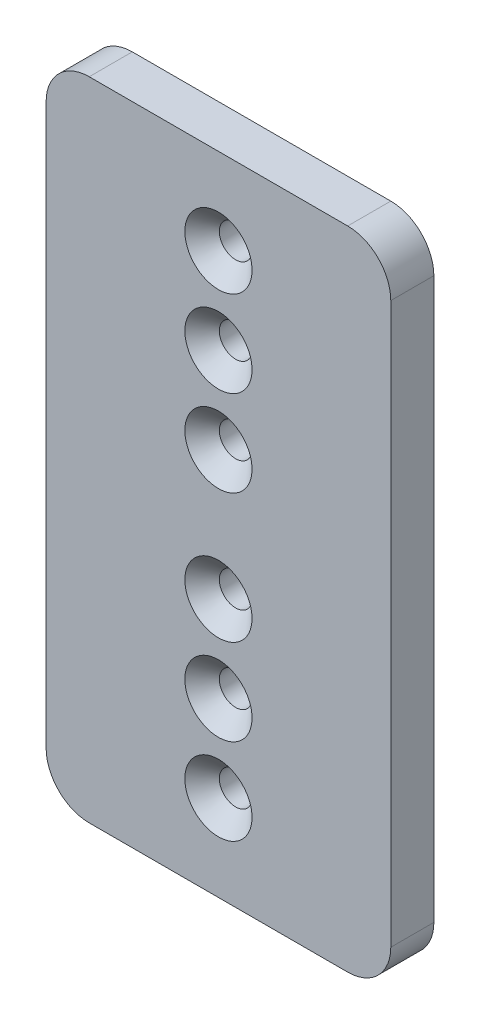
ISO-10303-21;
HEADER;
FILE_DESCRIPTION(('STEP AP214'),'2;1');
FILE_NAME('part.step','',(''),(''),'','','');
FILE_SCHEMA(('AUTOMOTIVE_DESIGN { 1 0 10303 214 1 1 1 1 }'));
ENDSEC;
DATA;
#1=APPLICATION_CONTEXT('core data for automotive mechanical design processes');
#2=APPLICATION_PROTOCOL_DEFINITION('international standard','automotive_design',2000,#1);
#3=PRODUCT_CONTEXT('',#1,'mechanical');
#4=PRODUCT('Part','Part','',(#3));
#5=PRODUCT_RELATED_PRODUCT_CATEGORY('part','',(#4));
#6=PRODUCT_DEFINITION_FORMATION('','',#4);
#7=PRODUCT_DEFINITION_CONTEXT('part definition',#1,'design');
#8=PRODUCT_DEFINITION('design','',#6,#7);
#9=PRODUCT_DEFINITION_SHAPE('','',#8);
#10=(LENGTH_UNIT() NAMED_UNIT(*) SI_UNIT(.MILLI.,.METRE.));
#11=(NAMED_UNIT(*) PLANE_ANGLE_UNIT() SI_UNIT($,.RADIAN.));
#12=(NAMED_UNIT(*) SI_UNIT($,.STERADIAN.) SOLID_ANGLE_UNIT());
#13=UNCERTAINTY_MEASURE_WITH_UNIT(LENGTH_MEASURE(1.E-05),#10,'distance_accuracy_value','');
#14=(GEOMETRIC_REPRESENTATION_CONTEXT(3) GLOBAL_UNCERTAINTY_ASSIGNED_CONTEXT((#13)) GLOBAL_UNIT_ASSIGNED_CONTEXT((#10,
#11,#12)) REPRESENTATION_CONTEXT('',''));
#15=CARTESIAN_POINT('',(0.,0.,0.));
#16=DIRECTION('',(0.,0.,1.));
#17=DIRECTION('',(1.,0.,0.));
#18=AXIS2_PLACEMENT_3D('',#15,#16,#17);
#19=CARTESIAN_POINT('',(0.,95.25,6.35));
#20=DIRECTION('',(0.,0.,-1.));
#21=DIRECTION('',(-1.,0.,0.));
#22=AXIS2_PLACEMENT_3D('',#19,#20,#21);
#23=PLANE('',#22);
#24=CARTESIAN_POINT('',(25.4,12.7,6.35));
#25=DIRECTION('',(0.,0.,-1.));
#26=DIRECTION('',(-1.,0.,0.));
#27=AXIS2_PLACEMENT_3D('',#24,#25,#26);
#28=CIRCLE('',#27,4.953);
#29=CARTESIAN_POINT('',(20.447,12.7,6.35));
#30=VERTEX_POINT('',#29);
#31=EDGE_CURVE('E183',#30,#30,#28,.T.);
#32=ORIENTED_EDGE('',*,*,#31,.T.);
#33=EDGE_LOOP('',(#32));
#34=FACE_BOUND('',#33,.T.);
#35=CARTESIAN_POINT('',(25.4,82.55,6.35));
#36=DIRECTION('',(0.,0.,-1.));
#37=DIRECTION('',(-1.,0.,0.));
#38=AXIS2_PLACEMENT_3D('',#35,#36,#37);
#39=CIRCLE('',#38,4.953);
#40=CARTESIAN_POINT('',(20.447,82.55,6.35));
#41=VERTEX_POINT('',#40);
#42=EDGE_CURVE('E180',#41,#41,#39,.T.);
#43=ORIENTED_EDGE('',*,*,#42,.T.);
#44=EDGE_LOOP('',(#43));
#45=FACE_BOUND('',#44,.T.);
#46=CARTESIAN_POINT('',(25.4,57.15,6.35));
#47=DIRECTION('',(0.,0.,-1.));
#48=DIRECTION('',(-1.,0.,0.));
#49=AXIS2_PLACEMENT_3D('',#46,#47,#48);
#50=CIRCLE('',#49,4.953);
#51=CARTESIAN_POINT('',(20.447,57.15,6.35));
#52=VERTEX_POINT('',#51);
#53=EDGE_CURVE('E177',#52,#52,#50,.T.);
#54=ORIENTED_EDGE('',*,*,#53,.T.);
#55=EDGE_LOOP('',(#54));
#56=FACE_BOUND('',#55,.T.);
#57=CARTESIAN_POINT('',(25.4,38.1,6.35));
#58=DIRECTION('',(0.,0.,-1.));
#59=DIRECTION('',(-1.,0.,0.));
#60=AXIS2_PLACEMENT_3D('',#57,#58,#59);
#61=CIRCLE('',#60,4.953);
#62=CARTESIAN_POINT('',(20.447,38.1,6.35));
#63=VERTEX_POINT('',#62);
#64=EDGE_CURVE('E174',#63,#63,#61,.T.);
#65=ORIENTED_EDGE('',*,*,#64,.T.);
#66=EDGE_LOOP('',(#65));
#67=FACE_BOUND('',#66,.T.);
#68=CARTESIAN_POINT('',(25.4,25.4,6.35));
#69=DIRECTION('',(0.,0.,-1.));
#70=DIRECTION('',(-1.,0.,0.));
#71=AXIS2_PLACEMENT_3D('',#68,#69,#70);
#72=CIRCLE('',#71,4.95300000000001);
#73=CARTESIAN_POINT('',(20.447,25.4,6.35));
#74=VERTEX_POINT('',#73);
#75=EDGE_CURVE('E171',#74,#74,#72,.T.);
#76=ORIENTED_EDGE('',*,*,#75,.T.);
#77=EDGE_LOOP('',(#76));
#78=FACE_BOUND('',#77,.T.);
#79=CARTESIAN_POINT('',(25.4,69.85,6.35));
#80=DIRECTION('',(0.,0.,-1.));
#81=DIRECTION('',(-1.,0.,0.));
#82=AXIS2_PLACEMENT_3D('',#79,#80,#81);
#83=CIRCLE('',#82,4.953);
#84=CARTESIAN_POINT('',(20.447,69.85,6.35));
#85=VERTEX_POINT('',#84);
#86=EDGE_CURVE('E168',#85,#85,#83,.T.);
#87=ORIENTED_EDGE('',*,*,#86,.T.);
#88=EDGE_LOOP('',(#87));
#89=FACE_BOUND('',#88,.T.);
#90=DIRECTION('',(0.,-1.,0.));
#91=VECTOR('',#90,1.);
#92=CARTESIAN_POINT('',(0.,0.,6.35));
#93=LINE('',#92,#91);
#94=CARTESIAN_POINT('',(0.,88.9,6.35));
#95=VERTEX_POINT('',#94);
#96=CARTESIAN_POINT('',(0.,6.35,6.35));
#97=VERTEX_POINT('',#96);
#98=EDGE_CURVE('E139',#95,#97,#93,.T.);
#99=ORIENTED_EDGE('',*,*,#98,.T.);
#100=CARTESIAN_POINT('',(6.35,6.35,6.35));
#101=DIRECTION('',(0.,0.,-1.));
#102=DIRECTION('',(-1.,0.,0.));
#103=AXIS2_PLACEMENT_3D('',#100,#101,#102);
#104=CIRCLE('',#103,6.35);
#105=CARTESIAN_POINT('',(6.35,0.,6.35));
#106=VERTEX_POINT('',#105);
#107=EDGE_CURVE('E154',#97,#106,#104,.F.);
#108=ORIENTED_EDGE('',*,*,#107,.T.);
#109=DIRECTION('',(1.,0.,0.));
#110=VECTOR('',#109,1.);
#111=CARTESIAN_POINT('',(0.,0.,6.35));
#112=LINE('',#111,#110);
#113=CARTESIAN_POINT('',(44.45,0.,6.35));
#114=VERTEX_POINT('',#113);
#115=EDGE_CURVE('E121',#106,#114,#112,.T.);
#116=ORIENTED_EDGE('',*,*,#115,.T.);
#117=CARTESIAN_POINT('',(44.45,6.35,6.35));
#118=DIRECTION('',(0.,0.,-1.));
#119=DIRECTION('',(-1.,0.,0.));
#120=AXIS2_PLACEMENT_3D('',#117,#118,#119);
#121=CIRCLE('',#120,6.35);
#122=CARTESIAN_POINT('',(50.8,6.35000000000001,6.35));
#123=VERTEX_POINT('',#122);
#124=EDGE_CURVE('E152',#114,#123,#121,.F.);
#125=ORIENTED_EDGE('',*,*,#124,.T.);
#126=DIRECTION('',(0.,1.,0.));
#127=VECTOR('',#126,1.);
#128=CARTESIAN_POINT('',(50.8,0.,6.35));
#129=LINE('',#128,#127);
#130=CARTESIAN_POINT('',(50.8,88.9,6.35));
#131=VERTEX_POINT('',#130);
#132=EDGE_CURVE('E294',#123,#131,#129,.T.);
#133=ORIENTED_EDGE('',*,*,#132,.T.);
#134=CARTESIAN_POINT('',(44.45,88.9,6.35));
#135=DIRECTION('',(0.,0.,-1.));
#136=DIRECTION('',(-1.,0.,0.));
#137=AXIS2_PLACEMENT_3D('',#134,#135,#136);
#138=CIRCLE('',#137,6.35);
#139=CARTESIAN_POINT('',(44.45,95.25,6.35));
#140=VERTEX_POINT('',#139);
#141=EDGE_CURVE('E56',#131,#140,#138,.F.);
#142=ORIENTED_EDGE('',*,*,#141,.T.);
#143=DIRECTION('',(-1.,0.,0.));
#144=VECTOR('',#143,1.);
#145=CARTESIAN_POINT('',(0.,95.25,6.35));
#146=LINE('',#145,#144);
#147=CARTESIAN_POINT('',(6.35,95.25,6.35));
#148=VERTEX_POINT('',#147);
#149=EDGE_CURVE('E140',#140,#148,#146,.T.);
#150=ORIENTED_EDGE('',*,*,#149,.T.);
#151=CARTESIAN_POINT('',(6.35,88.9,6.35));
#152=DIRECTION('',(0.,0.,-1.));
#153=DIRECTION('',(-1.,0.,0.));
#154=AXIS2_PLACEMENT_3D('',#151,#152,#153);
#155=CIRCLE('',#154,6.35);
#156=EDGE_CURVE('E149',#148,#95,#155,.F.);
#157=ORIENTED_EDGE('',*,*,#156,.T.);
#158=EDGE_LOOP('',(#99,#108,#116,#125,#133,#142,#150,#157));
#159=FACE_BOUND('',#158,.T.);
#160=ADVANCED_FACE('F34',(#34,#45,#56,#67,#78,#89,#159),#23,.F.);
#161=CARTESIAN_POINT('',(0.,95.25,0.));
#162=DIRECTION('',(0.,0.,-1.));
#163=DIRECTION('',(-1.,0.,0.));
#164=AXIS2_PLACEMENT_3D('',#161,#162,#163);
#165=PLANE('',#164);
#166=CARTESIAN_POINT('',(25.4,38.1,0.));
#167=DIRECTION('',(0.,0.,1.));
#168=DIRECTION('',(1.,0.,0.));
#169=AXIS2_PLACEMENT_3D('',#166,#167,#168);
#170=CIRCLE('',#169,2.413);
#171=CARTESIAN_POINT('',(27.813,38.1,0.));
#172=VERTEX_POINT('',#171);
#173=EDGE_CURVE('E285',#172,#172,#170,.T.);
#174=ORIENTED_EDGE('',*,*,#173,.T.);
#175=EDGE_LOOP('',(#174));
#176=FACE_BOUND('',#175,.T.);
#177=CARTESIAN_POINT('',(25.4,57.15,0.));
#178=DIRECTION('',(0.,0.,1.));
#179=DIRECTION('',(1.,0.,0.));
#180=AXIS2_PLACEMENT_3D('',#177,#178,#179);
#181=CIRCLE('',#180,2.413);
#182=CARTESIAN_POINT('',(27.813,57.15,0.));
#183=VERTEX_POINT('',#182);
#184=EDGE_CURVE('E277',#183,#183,#181,.T.);
#185=ORIENTED_EDGE('',*,*,#184,.T.);
#186=EDGE_LOOP('',(#185));
#187=FACE_BOUND('',#186,.T.);
#188=CARTESIAN_POINT('',(25.4,69.85,0.));
#189=DIRECTION('',(0.,0.,1.));
#190=DIRECTION('',(1.,0.,0.));
#191=AXIS2_PLACEMENT_3D('',#188,#189,#190);
#192=CIRCLE('',#191,2.413);
#193=CARTESIAN_POINT('',(27.813,69.85,0.));
#194=VERTEX_POINT('',#193);
#195=EDGE_CURVE('E134',#194,#194,#192,.T.);
#196=ORIENTED_EDGE('',*,*,#195,.T.);
#197=EDGE_LOOP('',(#196));
#198=FACE_BOUND('',#197,.T.);
#199=DIRECTION('',(1.,0.,0.));
#200=VECTOR('',#199,1.);
#201=CARTESIAN_POINT('',(0.,0.,0.));
#202=LINE('',#201,#200);
#203=CARTESIAN_POINT('',(6.35,0.,0.));
#204=VERTEX_POINT('',#203);
#205=CARTESIAN_POINT('',(44.45,0.,0.));
#206=VERTEX_POINT('',#205);
#207=EDGE_CURVE('E118',#204,#206,#202,.T.);
#208=ORIENTED_EDGE('',*,*,#207,.F.);
#209=CARTESIAN_POINT('',(6.35,6.35,0.));
#210=DIRECTION('',(0.,0.,-1.));
#211=DIRECTION('',(-1.,0.,0.));
#212=AXIS2_PLACEMENT_3D('',#209,#210,#211);
#213=CIRCLE('',#212,6.35);
#214=CARTESIAN_POINT('',(0.,6.35,0.));
#215=VERTEX_POINT('',#214);
#216=EDGE_CURVE('E101',#204,#215,#213,.T.);
#217=ORIENTED_EDGE('',*,*,#216,.T.);
#218=DIRECTION('',(0.,-1.,0.));
#219=VECTOR('',#218,1.);
#220=CARTESIAN_POINT('',(0.,0.,0.));
#221=LINE('',#220,#219);
#222=CARTESIAN_POINT('',(0.,88.9,0.));
#223=VERTEX_POINT('',#222);
#224=EDGE_CURVE('E129',#223,#215,#221,.T.);
#225=ORIENTED_EDGE('',*,*,#224,.F.);
#226=CARTESIAN_POINT('',(6.35,88.9,0.));
#227=DIRECTION('',(0.,0.,-1.));
#228=DIRECTION('',(-1.,0.,0.));
#229=AXIS2_PLACEMENT_3D('',#226,#227,#228);
#230=CIRCLE('',#229,6.35);
#231=CARTESIAN_POINT('',(6.35,95.25,0.));
#232=VERTEX_POINT('',#231);
#233=EDGE_CURVE('E122',#223,#232,#230,.T.);
#234=ORIENTED_EDGE('',*,*,#233,.T.);
#235=DIRECTION('',(-1.,0.,0.));
#236=VECTOR('',#235,1.);
#237=CARTESIAN_POINT('',(0.,95.25,0.));
#238=LINE('',#237,#236);
#239=CARTESIAN_POINT('',(44.45,95.25,0.));
#240=VERTEX_POINT('',#239);
#241=EDGE_CURVE('E132',#240,#232,#238,.T.);
#242=ORIENTED_EDGE('',*,*,#241,.F.);
#243=CARTESIAN_POINT('',(44.45,88.9,0.));
#244=DIRECTION('',(0.,0.,-1.));
#245=DIRECTION('',(-1.,0.,0.));
#246=AXIS2_PLACEMENT_3D('',#243,#244,#245);
#247=CIRCLE('',#246,6.35);
#248=CARTESIAN_POINT('',(50.8,88.9,0.));
#249=VERTEX_POINT('',#248);
#250=EDGE_CURVE('E143',#240,#249,#247,.T.);
#251=ORIENTED_EDGE('',*,*,#250,.T.);
#252=DIRECTION('',(0.,1.,0.));
#253=VECTOR('',#252,1.);
#254=CARTESIAN_POINT('',(50.8,0.,0.));
#255=LINE('',#254,#253);
#256=CARTESIAN_POINT('',(50.8,6.35000000000001,0.));
#257=VERTEX_POINT('',#256);
#258=EDGE_CURVE('E128',#257,#249,#255,.T.);
#259=ORIENTED_EDGE('',*,*,#258,.F.);
#260=CARTESIAN_POINT('',(44.45,6.35,0.));
#261=DIRECTION('',(0.,0.,-1.));
#262=DIRECTION('',(-1.,0.,0.));
#263=AXIS2_PLACEMENT_3D('',#260,#261,#262);
#264=CIRCLE('',#263,6.35);
#265=EDGE_CURVE('E112',#257,#206,#264,.T.);
#266=ORIENTED_EDGE('',*,*,#265,.T.);
#267=EDGE_LOOP('',(#208,#217,#225,#234,#242,#251,#259,#266));
#268=FACE_BOUND('',#267,.T.);
#269=CARTESIAN_POINT('',(25.4,25.4,0.));
#270=DIRECTION('',(0.,0.,1.));
#271=DIRECTION('',(1.,0.,0.));
#272=AXIS2_PLACEMENT_3D('',#269,#270,#271);
#273=CIRCLE('',#272,2.413);
#274=CARTESIAN_POINT('',(27.813,25.4,0.));
#275=VERTEX_POINT('',#274);
#276=EDGE_CURVE('E279',#275,#275,#273,.T.);
#277=ORIENTED_EDGE('',*,*,#276,.T.);
#278=EDGE_LOOP('',(#277));
#279=FACE_BOUND('',#278,.T.);
#280=CARTESIAN_POINT('',(25.4,12.7,0.));
#281=DIRECTION('',(0.,0.,1.));
#282=DIRECTION('',(1.,0.,0.));
#283=AXIS2_PLACEMENT_3D('',#280,#281,#282);
#284=CIRCLE('',#283,2.413);
#285=CARTESIAN_POINT('',(27.813,12.7,0.));
#286=VERTEX_POINT('',#285);
#287=EDGE_CURVE('E280',#286,#286,#284,.T.);
#288=ORIENTED_EDGE('',*,*,#287,.T.);
#289=EDGE_LOOP('',(#288));
#290=FACE_BOUND('',#289,.T.);
#291=CARTESIAN_POINT('',(25.4,82.55,0.));
#292=DIRECTION('',(0.,0.,1.));
#293=DIRECTION('',(1.,0.,0.));
#294=AXIS2_PLACEMENT_3D('',#291,#292,#293);
#295=CIRCLE('',#294,2.413);
#296=CARTESIAN_POINT('',(27.813,82.55,0.));
#297=VERTEX_POINT('',#296);
#298=EDGE_CURVE('E332',#297,#297,#295,.T.);
#299=ORIENTED_EDGE('',*,*,#298,.T.);
#300=EDGE_LOOP('',(#299));
#301=FACE_BOUND('',#300,.T.);
#302=ADVANCED_FACE('F125',(#176,#187,#198,#268,#279,#290,#301),#165,.T.);
#303=CARTESIAN_POINT('',(0.,0.,6.35));
#304=DIRECTION('',(1.,0.,0.));
#305=DIRECTION('',(0.,0.,-1.));
#306=AXIS2_PLACEMENT_3D('',#303,#304,#305);
#307=PLANE('',#306);
#308=ORIENTED_EDGE('',*,*,#224,.T.);
#309=DIRECTION('',(0.,0.,-1.));
#310=VECTOR('',#309,1.);
#311=CARTESIAN_POINT('',(0.,6.35,6.35));
#312=LINE('',#311,#310);
#313=EDGE_CURVE('E106',#215,#97,#312,.F.);
#314=ORIENTED_EDGE('',*,*,#313,.T.);
#315=ORIENTED_EDGE('',*,*,#98,.F.);
#316=DIRECTION('',(0.,0.,-1.));
#317=VECTOR('',#316,1.);
#318=CARTESIAN_POINT('',(0.,88.9,6.35));
#319=LINE('',#318,#317);
#320=EDGE_CURVE('E111',#95,#223,#319,.T.);
#321=ORIENTED_EDGE('',*,*,#320,.T.);
#322=EDGE_LOOP('',(#308,#314,#315,#321));
#323=FACE_BOUND('',#322,.T.);
#324=ADVANCED_FACE('F219',(#323),#307,.F.);
#325=CARTESIAN_POINT('',(0.,0.,6.35));
#326=DIRECTION('',(0.,1.,0.));
#327=DIRECTION('',(-1.,0.,0.));
#328=AXIS2_PLACEMENT_3D('',#325,#326,#327);
#329=PLANE('',#328);
#330=ORIENTED_EDGE('',*,*,#115,.F.);
#331=DIRECTION('',(0.,0.,-1.));
#332=VECTOR('',#331,1.);
#333=CARTESIAN_POINT('',(6.35,0.,6.35));
#334=LINE('',#333,#332);
#335=EDGE_CURVE('E105',#106,#204,#334,.T.);
#336=ORIENTED_EDGE('',*,*,#335,.T.);
#337=ORIENTED_EDGE('',*,*,#207,.T.);
#338=DIRECTION('',(0.,0.,-1.));
#339=VECTOR('',#338,1.);
#340=CARTESIAN_POINT('',(44.45,0.,6.35));
#341=LINE('',#340,#339);
#342=EDGE_CURVE('E123',#206,#114,#341,.F.);
#343=ORIENTED_EDGE('',*,*,#342,.T.);
#344=EDGE_LOOP('',(#330,#336,#337,#343));
#345=FACE_BOUND('',#344,.T.);
#346=ADVANCED_FACE('F117',(#345),#329,.F.);
#347=CARTESIAN_POINT('',(50.8,0.,6.35));
#348=DIRECTION('',(-1.,0.,0.));
#349=DIRECTION('',(0.,-1.,0.));
#350=AXIS2_PLACEMENT_3D('',#347,#348,#349);
#351=PLANE('',#350);
#352=ORIENTED_EDGE('',*,*,#132,.F.);
#353=DIRECTION('',(0.,0.,-1.));
#354=VECTOR('',#353,1.);
#355=CARTESIAN_POINT('',(50.8,6.35000000000001,6.35));
#356=LINE('',#355,#354);
#357=EDGE_CURVE('E158',#123,#257,#356,.T.);
#358=ORIENTED_EDGE('',*,*,#357,.T.);
#359=ORIENTED_EDGE('',*,*,#258,.T.);
#360=DIRECTION('',(0.,0.,-1.));
#361=VECTOR('',#360,1.);
#362=CARTESIAN_POINT('',(50.8,88.9,6.35));
#363=LINE('',#362,#361);
#364=EDGE_CURVE('E156',#249,#131,#363,.F.);
#365=ORIENTED_EDGE('',*,*,#364,.T.);
#366=EDGE_LOOP('',(#352,#358,#359,#365));
#367=FACE_BOUND('',#366,.T.);
#368=ADVANCED_FACE('F230',(#367),#351,.F.);
#369=CARTESIAN_POINT('',(0.,95.25,6.35));
#370=DIRECTION('',(0.,-1.,0.));
#371=DIRECTION('',(0.,0.,-1.));
#372=AXIS2_PLACEMENT_3D('',#369,#370,#371);
#373=PLANE('',#372);
#374=ORIENTED_EDGE('',*,*,#149,.F.);
#375=DIRECTION('',(0.,0.,-1.));
#376=VECTOR('',#375,1.);
#377=CARTESIAN_POINT('',(44.45,95.25,6.35));
#378=LINE('',#377,#376);
#379=EDGE_CURVE('E162',#140,#240,#378,.T.);
#380=ORIENTED_EDGE('',*,*,#379,.T.);
#381=ORIENTED_EDGE('',*,*,#241,.T.);
#382=DIRECTION('',(0.,0.,-1.));
#383=VECTOR('',#382,1.);
#384=CARTESIAN_POINT('',(6.35,95.25,6.35));
#385=LINE('',#384,#383);
#386=EDGE_CURVE('E49',#232,#148,#385,.F.);
#387=ORIENTED_EDGE('',*,*,#386,.T.);
#388=EDGE_LOOP('',(#374,#380,#381,#387));
#389=FACE_BOUND('',#388,.T.);
#390=ADVANCED_FACE('F227',(#389),#373,.F.);
#391=CARTESIAN_POINT('',(25.4,69.85,6.35));
#392=DIRECTION('',(0.,0.,-1.));
#393=DIRECTION('',(-1.,0.,0.));
#394=AXIS2_PLACEMENT_3D('',#391,#392,#393);
#395=CYLINDRICAL_SURFACE('',#394,2.413);
#396=CARTESIAN_POINT('',(25.4,69.85,3.81000000000002));
#397=DIRECTION('',(0.,0.,-1.));
#398=DIRECTION('',(-1.,0.,0.));
#399=AXIS2_PLACEMENT_3D('',#396,#397,#398);
#400=CIRCLE('',#399,2.413);
#401=CARTESIAN_POINT('',(22.987,69.85,3.81000000000002));
#402=VERTEX_POINT('',#401);
#403=EDGE_CURVE('E11',#402,#402,#400,.F.);
#404=ORIENTED_EDGE('',*,*,#403,.T.);
#405=EDGE_LOOP('',(#404));
#406=FACE_BOUND('',#405,.T.);
#407=ORIENTED_EDGE('',*,*,#195,.F.);
#408=EDGE_LOOP('',(#407));
#409=FACE_BOUND('',#408,.T.);
#410=ADVANCED_FACE('F224',(#406,#409),#395,.F.);
#411=CARTESIAN_POINT('',(25.4,25.4,6.35));
#412=DIRECTION('',(0.,0.,-1.));
#413=DIRECTION('',(-1.,0.,0.));
#414=AXIS2_PLACEMENT_3D('',#411,#412,#413);
#415=CYLINDRICAL_SURFACE('',#414,2.413);
#416=CARTESIAN_POINT('',(25.4,25.4,3.80999999999999));
#417=DIRECTION('',(0.,0.,-1.));
#418=DIRECTION('',(-1.,0.,0.));
#419=AXIS2_PLACEMENT_3D('',#416,#417,#418);
#420=CIRCLE('',#419,2.413);
#421=CARTESIAN_POINT('',(22.987,25.4,3.80999999999999));
#422=VERTEX_POINT('',#421);
#423=EDGE_CURVE('E42',#422,#422,#420,.F.);
#424=ORIENTED_EDGE('',*,*,#423,.T.);
#425=EDGE_LOOP('',(#424));
#426=FACE_BOUND('',#425,.T.);
#427=ORIENTED_EDGE('',*,*,#276,.F.);
#428=EDGE_LOOP('',(#427));
#429=FACE_BOUND('',#428,.T.);
#430=ADVANCED_FACE('F197',(#426,#429),#415,.F.);
#431=CARTESIAN_POINT('',(25.4,57.15,6.35));
#432=DIRECTION('',(0.,0.,-1.));
#433=DIRECTION('',(-1.,0.,0.));
#434=AXIS2_PLACEMENT_3D('',#431,#432,#433);
#435=CYLINDRICAL_SURFACE('',#434,2.413);
#436=CARTESIAN_POINT('',(25.4,57.15,3.81000000000002));
#437=DIRECTION('',(0.,0.,-1.));
#438=DIRECTION('',(-1.,0.,0.));
#439=AXIS2_PLACEMENT_3D('',#436,#437,#438);
#440=CIRCLE('',#439,2.413);
#441=CARTESIAN_POINT('',(22.987,57.15,3.81000000000002));
#442=VERTEX_POINT('',#441);
#443=EDGE_CURVE('E189',#442,#442,#440,.F.);
#444=ORIENTED_EDGE('',*,*,#443,.T.);
#445=EDGE_LOOP('',(#444));
#446=FACE_BOUND('',#445,.T.);
#447=ORIENTED_EDGE('',*,*,#184,.F.);
#448=EDGE_LOOP('',(#447));
#449=FACE_BOUND('',#448,.T.);
#450=ADVANCED_FACE('F270',(#446,#449),#435,.F.);
#451=CARTESIAN_POINT('',(25.4,12.7,6.35));
#452=DIRECTION('',(0.,0.,-1.));
#453=DIRECTION('',(-1.,0.,0.));
#454=AXIS2_PLACEMENT_3D('',#451,#452,#453);
#455=CYLINDRICAL_SURFACE('',#454,2.413);
#456=CARTESIAN_POINT('',(25.4,12.7,3.81000000000002));
#457=DIRECTION('',(0.,0.,-1.));
#458=DIRECTION('',(-1.,0.,0.));
#459=AXIS2_PLACEMENT_3D('',#456,#457,#458);
#460=CIRCLE('',#459,2.413);
#461=CARTESIAN_POINT('',(22.987,12.7,3.81000000000002));
#462=VERTEX_POINT('',#461);
#463=EDGE_CURVE('E165',#462,#462,#460,.F.);
#464=ORIENTED_EDGE('',*,*,#463,.T.);
#465=EDGE_LOOP('',(#464));
#466=FACE_BOUND('',#465,.T.);
#467=ORIENTED_EDGE('',*,*,#287,.F.);
#468=EDGE_LOOP('',(#467));
#469=FACE_BOUND('',#468,.T.);
#470=ADVANCED_FACE('F273',(#466,#469),#455,.F.);
#471=CARTESIAN_POINT('',(25.4,38.1,6.35));
#472=DIRECTION('',(0.,0.,-1.));
#473=DIRECTION('',(-1.,0.,0.));
#474=AXIS2_PLACEMENT_3D('',#471,#472,#473);
#475=CYLINDRICAL_SURFACE('',#474,2.413);
#476=CARTESIAN_POINT('',(25.4,38.1,3.81000000000002));
#477=DIRECTION('',(0.,0.,-1.));
#478=DIRECTION('',(-1.,0.,0.));
#479=AXIS2_PLACEMENT_3D('',#476,#477,#478);
#480=CIRCLE('',#479,2.413);
#481=CARTESIAN_POINT('',(22.987,38.1,3.81000000000002));
#482=VERTEX_POINT('',#481);
#483=EDGE_CURVE('E192',#482,#482,#480,.F.);
#484=ORIENTED_EDGE('',*,*,#483,.T.);
#485=EDGE_LOOP('',(#484));
#486=FACE_BOUND('',#485,.T.);
#487=ORIENTED_EDGE('',*,*,#173,.F.);
#488=EDGE_LOOP('',(#487));
#489=FACE_BOUND('',#488,.T.);
#490=ADVANCED_FACE('F319',(#486,#489),#475,.F.);
#491=CARTESIAN_POINT('',(25.4,82.55,6.35));
#492=DIRECTION('',(0.,0.,-1.));
#493=DIRECTION('',(-1.,0.,0.));
#494=AXIS2_PLACEMENT_3D('',#491,#492,#493);
#495=CYLINDRICAL_SURFACE('',#494,2.413);
#496=CARTESIAN_POINT('',(25.4,82.55,3.81000000000002));
#497=DIRECTION('',(0.,0.,-1.));
#498=DIRECTION('',(-1.,0.,0.));
#499=AXIS2_PLACEMENT_3D('',#496,#497,#498);
#500=CIRCLE('',#499,2.413);
#501=CARTESIAN_POINT('',(22.987,82.55,3.81000000000002));
#502=VERTEX_POINT('',#501);
#503=EDGE_CURVE('E186',#502,#502,#500,.F.);
#504=ORIENTED_EDGE('',*,*,#503,.T.);
#505=EDGE_LOOP('',(#504));
#506=FACE_BOUND('',#505,.T.);
#507=ORIENTED_EDGE('',*,*,#298,.F.);
#508=EDGE_LOOP('',(#507));
#509=FACE_BOUND('',#508,.T.);
#510=ADVANCED_FACE('F242',(#506,#509),#495,.F.);
#511=CARTESIAN_POINT('',(6.35,6.35,6.35));
#512=DIRECTION('',(0.,0.,-1.));
#513=DIRECTION('',(-1.,0.,0.));
#514=AXIS2_PLACEMENT_3D('',#511,#512,#513);
#515=CYLINDRICAL_SURFACE('',#514,6.35);
#516=ORIENTED_EDGE('',*,*,#107,.F.);
#517=ORIENTED_EDGE('',*,*,#313,.F.);
#518=ORIENTED_EDGE('',*,*,#216,.F.);
#519=ORIENTED_EDGE('',*,*,#335,.F.);
#520=EDGE_LOOP('',(#516,#517,#518,#519));
#521=FACE_BOUND('',#520,.T.);
#522=ADVANCED_FACE('F104',(#521),#515,.T.);
#523=CARTESIAN_POINT('',(44.45,6.35,6.35));
#524=DIRECTION('',(0.,0.,-1.));
#525=DIRECTION('',(-1.,0.,0.));
#526=AXIS2_PLACEMENT_3D('',#523,#524,#525);
#527=CYLINDRICAL_SURFACE('',#526,6.35);
#528=ORIENTED_EDGE('',*,*,#124,.F.);
#529=ORIENTED_EDGE('',*,*,#342,.F.);
#530=ORIENTED_EDGE('',*,*,#265,.F.);
#531=ORIENTED_EDGE('',*,*,#357,.F.);
#532=EDGE_LOOP('',(#528,#529,#530,#531));
#533=FACE_BOUND('',#532,.T.);
#534=ADVANCED_FACE('F241',(#533),#527,.T.);
#535=CARTESIAN_POINT('',(44.45,88.9,6.35));
#536=DIRECTION('',(0.,0.,-1.));
#537=DIRECTION('',(-1.,0.,0.));
#538=AXIS2_PLACEMENT_3D('',#535,#536,#537);
#539=CYLINDRICAL_SURFACE('',#538,6.35);
#540=ORIENTED_EDGE('',*,*,#141,.F.);
#541=ORIENTED_EDGE('',*,*,#364,.F.);
#542=ORIENTED_EDGE('',*,*,#250,.F.);
#543=ORIENTED_EDGE('',*,*,#379,.F.);
#544=EDGE_LOOP('',(#540,#541,#542,#543));
#545=FACE_BOUND('',#544,.T.);
#546=ADVANCED_FACE('F245',(#545),#539,.T.);
#547=CARTESIAN_POINT('',(6.35,88.9,6.35));
#548=DIRECTION('',(0.,0.,-1.));
#549=DIRECTION('',(-1.,0.,0.));
#550=AXIS2_PLACEMENT_3D('',#547,#548,#549);
#551=CYLINDRICAL_SURFACE('',#550,6.35);
#552=ORIENTED_EDGE('',*,*,#156,.F.);
#553=ORIENTED_EDGE('',*,*,#386,.F.);
#554=ORIENTED_EDGE('',*,*,#233,.F.);
#555=ORIENTED_EDGE('',*,*,#320,.F.);
#556=EDGE_LOOP('',(#552,#553,#554,#555));
#557=FACE_BOUND('',#556,.T.);
#558=ADVANCED_FACE('F249',(#557),#551,.T.);
#559=CARTESIAN_POINT('',(25.4,12.7,3.81000000000002));
#560=DIRECTION('',(0.,0.,1.));
#561=DIRECTION('',(1.,0.,0.));
#562=AXIS2_PLACEMENT_3D('',#559,#560,#561);
#563=CONICAL_SURFACE('',#562,2.413,0.785398163397452);
#564=ORIENTED_EDGE('',*,*,#31,.F.);
#565=EDGE_LOOP('',(#564));
#566=FACE_BOUND('',#565,.T.);
#567=ORIENTED_EDGE('',*,*,#463,.F.);
#568=EDGE_LOOP('',(#567));
#569=FACE_BOUND('',#568,.T.);
#570=ADVANCED_FACE('F253',(#566,#569),#563,.F.);
#571=CARTESIAN_POINT('',(25.4,82.55,3.81000000000002));
#572=DIRECTION('',(0.,0.,1.));
#573=DIRECTION('',(1.,0.,0.));
#574=AXIS2_PLACEMENT_3D('',#571,#572,#573);
#575=CONICAL_SURFACE('',#574,2.413,0.785398163397452);
#576=ORIENTED_EDGE('',*,*,#42,.F.);
#577=EDGE_LOOP('',(#576));
#578=FACE_BOUND('',#577,.T.);
#579=ORIENTED_EDGE('',*,*,#503,.F.);
#580=EDGE_LOOP('',(#579));
#581=FACE_BOUND('',#580,.T.);
#582=ADVANCED_FACE('F257',(#578,#581),#575,.F.);
#583=CARTESIAN_POINT('',(25.4,57.15,3.81000000000002));
#584=DIRECTION('',(0.,0.,1.));
#585=DIRECTION('',(1.,0.,0.));
#586=AXIS2_PLACEMENT_3D('',#583,#584,#585);
#587=CONICAL_SURFACE('',#586,2.413,0.785398163397452);
#588=ORIENTED_EDGE('',*,*,#53,.F.);
#589=EDGE_LOOP('',(#588));
#590=FACE_BOUND('',#589,.T.);
#591=ORIENTED_EDGE('',*,*,#443,.F.);
#592=EDGE_LOOP('',(#591));
#593=FACE_BOUND('',#592,.T.);
#594=ADVANCED_FACE('F209',(#590,#593),#587,.F.);
#595=CARTESIAN_POINT('',(25.4,38.1,3.81000000000002));
#596=DIRECTION('',(0.,0.,1.));
#597=DIRECTION('',(1.,0.,0.));
#598=AXIS2_PLACEMENT_3D('',#595,#596,#597);
#599=CONICAL_SURFACE('',#598,2.413,0.785398163397452);
#600=ORIENTED_EDGE('',*,*,#64,.F.);
#601=EDGE_LOOP('',(#600));
#602=FACE_BOUND('',#601,.T.);
#603=ORIENTED_EDGE('',*,*,#483,.F.);
#604=EDGE_LOOP('',(#603));
#605=FACE_BOUND('',#604,.T.);
#606=ADVANCED_FACE('F202',(#602,#605),#599,.F.);
#607=CARTESIAN_POINT('',(25.4,25.4,3.80999999999999));
#608=DIRECTION('',(0.,0.,1.));
#609=DIRECTION('',(1.,0.,0.));
#610=AXIS2_PLACEMENT_3D('',#607,#608,#609);
#611=CONICAL_SURFACE('',#610,2.413,0.785398163397449);
#612=ORIENTED_EDGE('',*,*,#75,.F.);
#613=EDGE_LOOP('',(#612));
#614=FACE_BOUND('',#613,.T.);
#615=ORIENTED_EDGE('',*,*,#423,.F.);
#616=EDGE_LOOP('',(#615));
#617=FACE_BOUND('',#616,.T.);
#618=ADVANCED_FACE('F200',(#614,#617),#611,.F.);
#619=CARTESIAN_POINT('',(25.4,69.85,3.81000000000002));
#620=DIRECTION('',(0.,0.,1.));
#621=DIRECTION('',(1.,0.,0.));
#622=AXIS2_PLACEMENT_3D('',#619,#620,#621);
#623=CONICAL_SURFACE('',#622,2.413,0.785398163397452);
#624=ORIENTED_EDGE('',*,*,#86,.F.);
#625=EDGE_LOOP('',(#624));
#626=FACE_BOUND('',#625,.T.);
#627=ORIENTED_EDGE('',*,*,#403,.F.);
#628=EDGE_LOOP('',(#627));
#629=FACE_BOUND('',#628,.T.);
#630=ADVANCED_FACE('F36',(#626,#629),#623,.F.);
#631=CLOSED_SHELL('',(#160,#302,#324,#346,#368,#390,#410,#430,#450,#470,#490,#510,#522,#534,
#546,#558,#570,#582,#594,#606,#618,#630));
#632=MANIFOLD_SOLID_BREP('B2',#631);
#633=ADVANCED_BREP_SHAPE_REPRESENTATION('',(#18,#632),#14);
#634=SHAPE_DEFINITION_REPRESENTATION(#9,#633);
ENDSEC;
END-ISO-10303-21;
